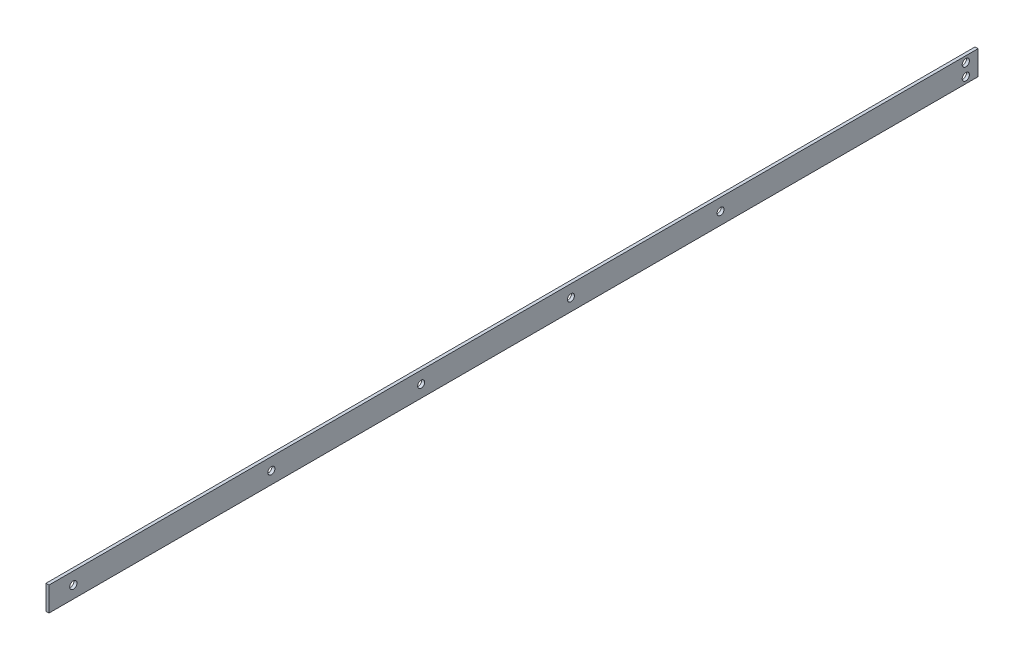
ISO-10303-21;
HEADER;
FILE_DESCRIPTION(('STEP AP214'),'2;1');
FILE_NAME('part.step','',(''),(''),'','','');
FILE_SCHEMA(('AUTOMOTIVE_DESIGN { 1 0 10303 214 1 1 1 1 }'));
ENDSEC;
DATA;
#1=APPLICATION_CONTEXT('core data for automotive mechanical design processes');
#2=APPLICATION_PROTOCOL_DEFINITION('international standard','automotive_design',2000,#1);
#3=PRODUCT_CONTEXT('',#1,'mechanical');
#4=PRODUCT('Part','Part','',(#3));
#5=PRODUCT_RELATED_PRODUCT_CATEGORY('part','',(#4));
#6=PRODUCT_DEFINITION_FORMATION('','',#4);
#7=PRODUCT_DEFINITION_CONTEXT('part definition',#1,'design');
#8=PRODUCT_DEFINITION('design','',#6,#7);
#9=PRODUCT_DEFINITION_SHAPE('','',#8);
#10=(LENGTH_UNIT() NAMED_UNIT(*) SI_UNIT(.MILLI.,.METRE.));
#11=(NAMED_UNIT(*) PLANE_ANGLE_UNIT() SI_UNIT($,.RADIAN.));
#12=(NAMED_UNIT(*) SI_UNIT($,.STERADIAN.) SOLID_ANGLE_UNIT());
#13=UNCERTAINTY_MEASURE_WITH_UNIT(LENGTH_MEASURE(1.E-05),#10,'distance_accuracy_value','');
#14=(GEOMETRIC_REPRESENTATION_CONTEXT(3) GLOBAL_UNCERTAINTY_ASSIGNED_CONTEXT((#13)) GLOBAL_UNIT_ASSIGNED_CONTEXT((#10,
#11,#12)) REPRESENTATION_CONTEXT('',''));
#15=CARTESIAN_POINT('',(0.,0.,0.));
#16=DIRECTION('',(0.,0.,1.));
#17=DIRECTION('',(1.,0.,0.));
#18=AXIS2_PLACEMENT_3D('',#15,#16,#17);
#19=CARTESIAN_POINT('',(0.,0.,485.14));
#20=DIRECTION('',(1.,0.,0.));
#21=DIRECTION('',(0.,1.,0.));
#22=AXIS2_PLACEMENT_3D('',#19,#20,#21);
#23=PLANE('',#22);
#24=CARTESIAN_POINT('',(0.,6.35000000000007,369.033439454375));
#25=DIRECTION('',(1.,0.,0.));
#26=DIRECTION('',(0.,0.,-1.));
#27=AXIS2_PLACEMENT_3D('',#24,#25,#26);
#28=CIRCLE('',#27,1.8288);
#29=CARTESIAN_POINT('',(0.,6.35000000000007,367.204639454375));
#30=VERTEX_POINT('',#29);
#31=EDGE_CURVE('E146',#30,#30,#28,.T.);
#32=ORIENTED_EDGE('',*,*,#31,.T.);
#33=EDGE_LOOP('',(#32));
#34=FACE_BOUND('',#33,.T.);
#35=CARTESIAN_POINT('',(0.,6.35000000000007,290.801439454375));
#36=DIRECTION('',(1.,0.,0.));
#37=DIRECTION('',(0.,0.,-1.));
#38=AXIS2_PLACEMENT_3D('',#35,#36,#37);
#39=CIRCLE('',#38,1.8288);
#40=CARTESIAN_POINT('',(0.,6.35000000000007,288.972639454375));
#41=VERTEX_POINT('',#40);
#42=EDGE_CURVE('E140',#41,#41,#39,.T.);
#43=ORIENTED_EDGE('',*,*,#42,.T.);
#44=EDGE_LOOP('',(#43));
#45=FACE_BOUND('',#44,.T.);
#46=CARTESIAN_POINT('',(0.,6.35000000000007,212.569439454375));
#47=DIRECTION('',(1.,0.,0.));
#48=DIRECTION('',(0.,0.,-1.));
#49=AXIS2_PLACEMENT_3D('',#46,#47,#48);
#50=CIRCLE('',#49,1.8288);
#51=CARTESIAN_POINT('',(0.,6.35000000000007,210.740639454375));
#52=VERTEX_POINT('',#51);
#53=EDGE_CURVE('E134',#52,#52,#50,.T.);
#54=ORIENTED_EDGE('',*,*,#53,.T.);
#55=EDGE_LOOP('',(#54));
#56=FACE_BOUND('',#55,.T.);
#57=CARTESIAN_POINT('',(0.,6.35000000000007,134.430638313341));
#58=DIRECTION('',(1.,0.,0.));
#59=DIRECTION('',(0.,0.,-1.));
#60=AXIS2_PLACEMENT_3D('',#57,#58,#59);
#61=CIRCLE('',#60,1.8288);
#62=CARTESIAN_POINT('',(0.,6.35000000000007,132.601838313341));
#63=VERTEX_POINT('',#62);
#64=EDGE_CURVE('E128',#63,#63,#61,.T.);
#65=ORIENTED_EDGE('',*,*,#64,.T.);
#66=EDGE_LOOP('',(#65));
#67=FACE_BOUND('',#66,.T.);
#68=CARTESIAN_POINT('',(0.,6.35,472.44));
#69=DIRECTION('',(1.,0.,0.));
#70=DIRECTION('',(0.,0.,-1.));
#71=AXIS2_PLACEMENT_3D('',#68,#69,#70);
#72=CIRCLE('',#71,1.89865);
#73=CARTESIAN_POINT('',(0.,6.35,470.54135));
#74=VERTEX_POINT('',#73);
#75=EDGE_CURVE('E122',#74,#74,#72,.T.);
#76=ORIENTED_EDGE('',*,*,#75,.T.);
#77=EDGE_LOOP('',(#76));
#78=FACE_BOUND('',#77,.T.);
#79=CARTESIAN_POINT('',(0.,9.525,6.35000000000002));
#80=DIRECTION('',(1.,0.,0.));
#81=DIRECTION('',(0.,0.,-1.));
#82=AXIS2_PLACEMENT_3D('',#79,#80,#81);
#83=CIRCLE('',#82,1.89865);
#84=CARTESIAN_POINT('',(0.,9.525,4.45135000000002));
#85=VERTEX_POINT('',#84);
#86=EDGE_CURVE('E116',#85,#85,#83,.T.);
#87=ORIENTED_EDGE('',*,*,#86,.T.);
#88=EDGE_LOOP('',(#87));
#89=FACE_BOUND('',#88,.T.);
#90=CARTESIAN_POINT('',(0.,3.175,6.35000000000002));
#91=DIRECTION('',(1.,0.,0.));
#92=DIRECTION('',(0.,0.,-1.));
#93=AXIS2_PLACEMENT_3D('',#90,#91,#92);
#94=CIRCLE('',#93,1.89865);
#95=CARTESIAN_POINT('',(0.,3.175,4.45135000000002));
#96=VERTEX_POINT('',#95);
#97=EDGE_CURVE('E100',#96,#96,#94,.T.);
#98=ORIENTED_EDGE('',*,*,#97,.T.);
#99=EDGE_LOOP('',(#98));
#100=FACE_BOUND('',#99,.T.);
#101=DIRECTION('',(0.,-1.,0.));
#102=VECTOR('',#101,1.);
#103=CARTESIAN_POINT('',(0.,0.,0.));
#104=LINE('',#103,#102);
#105=CARTESIAN_POINT('',(0.,12.7,0.));
#106=VERTEX_POINT('',#105);
#107=CARTESIAN_POINT('',(0.,0.,0.));
#108=VERTEX_POINT('',#107);
#109=EDGE_CURVE('E97',#106,#108,#104,.T.);
#110=ORIENTED_EDGE('',*,*,#109,.T.);
#111=DIRECTION('',(0.,0.,-1.));
#112=VECTOR('',#111,1.);
#113=CARTESIAN_POINT('',(0.,0.,485.14));
#114=LINE('',#113,#112);
#115=CARTESIAN_POINT('',(0.,0.,485.14));
#116=VERTEX_POINT('',#115);
#117=EDGE_CURVE('E11',#116,#108,#114,.T.);
#118=ORIENTED_EDGE('',*,*,#117,.F.);
#119=DIRECTION('',(0.,-1.,0.));
#120=VECTOR('',#119,1.);
#121=CARTESIAN_POINT('',(0.,0.,485.14));
#122=LINE('',#121,#120);
#123=CARTESIAN_POINT('',(0.,12.7,485.14));
#124=VERTEX_POINT('',#123);
#125=EDGE_CURVE('E85',#124,#116,#122,.T.);
#126=ORIENTED_EDGE('',*,*,#125,.F.);
#127=DIRECTION('',(0.,0.,-1.));
#128=VECTOR('',#127,1.);
#129=CARTESIAN_POINT('',(0.,12.7,485.14));
#130=LINE('',#129,#128);
#131=EDGE_CURVE('E93',#124,#106,#130,.T.);
#132=ORIENTED_EDGE('',*,*,#131,.T.);
#133=EDGE_LOOP('',(#110,#118,#126,#132));
#134=FACE_BOUND('',#133,.T.);
#135=ADVANCED_FACE('F34',(#34,#45,#56,#67,#78,#89,#100,#134),#23,.F.);
#136=CARTESIAN_POINT('',(0.,0.,485.14));
#137=DIRECTION('',(0.,1.,0.));
#138=DIRECTION('',(0.,0.,1.));
#139=AXIS2_PLACEMENT_3D('',#136,#137,#138);
#140=PLANE('',#139);
#141=DIRECTION('',(1.,0.,0.));
#142=VECTOR('',#141,1.);
#143=CARTESIAN_POINT('',(0.,0.,0.));
#144=LINE('',#143,#142);
#145=CARTESIAN_POINT('',(1.5875,0.,0.));
#146=VERTEX_POINT('',#145);
#147=EDGE_CURVE('E89',#108,#146,#144,.T.);
#148=ORIENTED_EDGE('',*,*,#147,.T.);
#149=DIRECTION('',(0.,0.,-1.));
#150=VECTOR('',#149,1.);
#151=CARTESIAN_POINT('',(1.5875,0.,485.14));
#152=LINE('',#151,#150);
#153=CARTESIAN_POINT('',(1.5875,0.,485.14));
#154=VERTEX_POINT('',#153);
#155=EDGE_CURVE('E42',#154,#146,#152,.T.);
#156=ORIENTED_EDGE('',*,*,#155,.F.);
#157=DIRECTION('',(1.,0.,0.));
#158=VECTOR('',#157,1.);
#159=CARTESIAN_POINT('',(0.,0.,485.14));
#160=LINE('',#159,#158);
#161=EDGE_CURVE('E80',#116,#154,#160,.T.);
#162=ORIENTED_EDGE('',*,*,#161,.F.);
#163=ORIENTED_EDGE('',*,*,#117,.T.);
#164=EDGE_LOOP('',(#148,#156,#162,#163));
#165=FACE_BOUND('',#164,.T.);
#166=ADVANCED_FACE('F88',(#165),#140,.F.);
#167=CARTESIAN_POINT('',(1.5875,0.,485.14));
#168=DIRECTION('',(-1.,0.,0.));
#169=DIRECTION('',(0.,-1.,0.));
#170=AXIS2_PLACEMENT_3D('',#167,#168,#169);
#171=PLANE('',#170);
#172=CARTESIAN_POINT('',(1.5875,6.35000000000007,369.033439454375));
#173=DIRECTION('',(1.,0.,0.));
#174=DIRECTION('',(0.,0.,-1.));
#175=AXIS2_PLACEMENT_3D('',#172,#173,#174);
#176=CIRCLE('',#175,1.82879999999999);
#177=CARTESIAN_POINT('',(1.5875,6.35000000000007,367.204639454375));
#178=VERTEX_POINT('',#177);
#179=EDGE_CURVE('E149',#178,#178,#176,.T.);
#180=ORIENTED_EDGE('',*,*,#179,.F.);
#181=EDGE_LOOP('',(#180));
#182=FACE_BOUND('',#181,.T.);
#183=CARTESIAN_POINT('',(1.5875,6.35000000000007,290.801439454375));
#184=DIRECTION('',(1.,0.,0.));
#185=DIRECTION('',(0.,0.,-1.));
#186=AXIS2_PLACEMENT_3D('',#183,#184,#185);
#187=CIRCLE('',#186,1.82879999999999);
#188=CARTESIAN_POINT('',(1.5875,6.35000000000007,288.972639454375));
#189=VERTEX_POINT('',#188);
#190=EDGE_CURVE('E143',#189,#189,#187,.T.);
#191=ORIENTED_EDGE('',*,*,#190,.F.);
#192=EDGE_LOOP('',(#191));
#193=FACE_BOUND('',#192,.T.);
#194=CARTESIAN_POINT('',(1.5875,6.35000000000007,212.569439454375));
#195=DIRECTION('',(1.,0.,0.));
#196=DIRECTION('',(0.,0.,-1.));
#197=AXIS2_PLACEMENT_3D('',#194,#195,#196);
#198=CIRCLE('',#197,1.82879999999999);
#199=CARTESIAN_POINT('',(1.5875,6.35000000000007,210.740639454375));
#200=VERTEX_POINT('',#199);
#201=EDGE_CURVE('E137',#200,#200,#198,.T.);
#202=ORIENTED_EDGE('',*,*,#201,.F.);
#203=EDGE_LOOP('',(#202));
#204=FACE_BOUND('',#203,.T.);
#205=CARTESIAN_POINT('',(1.5875,6.35000000000007,134.430638313341));
#206=DIRECTION('',(1.,0.,0.));
#207=DIRECTION('',(0.,0.,-1.));
#208=AXIS2_PLACEMENT_3D('',#205,#206,#207);
#209=CIRCLE('',#208,1.82879999999999);
#210=CARTESIAN_POINT('',(1.5875,6.35000000000007,132.601838313341));
#211=VERTEX_POINT('',#210);
#212=EDGE_CURVE('E131',#211,#211,#209,.T.);
#213=ORIENTED_EDGE('',*,*,#212,.F.);
#214=EDGE_LOOP('',(#213));
#215=FACE_BOUND('',#214,.T.);
#216=CARTESIAN_POINT('',(1.5875,6.35,472.44));
#217=DIRECTION('',(1.,0.,0.));
#218=DIRECTION('',(0.,0.,-1.));
#219=AXIS2_PLACEMENT_3D('',#216,#217,#218);
#220=CIRCLE('',#219,1.89865);
#221=CARTESIAN_POINT('',(1.5875,6.35,470.54135));
#222=VERTEX_POINT('',#221);
#223=EDGE_CURVE('E125',#222,#222,#220,.T.);
#224=ORIENTED_EDGE('',*,*,#223,.F.);
#225=EDGE_LOOP('',(#224));
#226=FACE_BOUND('',#225,.T.);
#227=CARTESIAN_POINT('',(1.5875,9.525,6.35000000000002));
#228=DIRECTION('',(1.,0.,0.));
#229=DIRECTION('',(0.,0.,-1.));
#230=AXIS2_PLACEMENT_3D('',#227,#228,#229);
#231=CIRCLE('',#230,1.89865);
#232=CARTESIAN_POINT('',(1.5875,9.525,4.45135000000002));
#233=VERTEX_POINT('',#232);
#234=EDGE_CURVE('E119',#233,#233,#231,.T.);
#235=ORIENTED_EDGE('',*,*,#234,.F.);
#236=EDGE_LOOP('',(#235));
#237=FACE_BOUND('',#236,.T.);
#238=CARTESIAN_POINT('',(1.5875,3.175,6.35000000000002));
#239=DIRECTION('',(1.,0.,0.));
#240=DIRECTION('',(0.,0.,-1.));
#241=AXIS2_PLACEMENT_3D('',#238,#239,#240);
#242=CIRCLE('',#241,1.89865);
#243=CARTESIAN_POINT('',(1.5875,3.175,4.45135000000002));
#244=VERTEX_POINT('',#243);
#245=EDGE_CURVE('E113',#244,#244,#242,.T.);
#246=ORIENTED_EDGE('',*,*,#245,.F.);
#247=EDGE_LOOP('',(#246));
#248=FACE_BOUND('',#247,.T.);
#249=DIRECTION('',(0.,1.,0.));
#250=VECTOR('',#249,1.);
#251=CARTESIAN_POINT('',(1.5875,0.,0.));
#252=LINE('',#251,#250);
#253=CARTESIAN_POINT('',(1.5875,12.7,0.));
#254=VERTEX_POINT('',#253);
#255=EDGE_CURVE('E67',#146,#254,#252,.T.);
#256=ORIENTED_EDGE('',*,*,#255,.T.);
#257=DIRECTION('',(0.,0.,-1.));
#258=VECTOR('',#257,1.);
#259=CARTESIAN_POINT('',(1.5875,12.7,485.14));
#260=LINE('',#259,#258);
#261=CARTESIAN_POINT('',(1.5875,12.7,485.14));
#262=VERTEX_POINT('',#261);
#263=EDGE_CURVE('E90',#262,#254,#260,.T.);
#264=ORIENTED_EDGE('',*,*,#263,.F.);
#265=DIRECTION('',(0.,1.,0.));
#266=VECTOR('',#265,1.);
#267=CARTESIAN_POINT('',(1.5875,0.,485.14));
#268=LINE('',#267,#266);
#269=EDGE_CURVE('E83',#154,#262,#268,.T.);
#270=ORIENTED_EDGE('',*,*,#269,.F.);
#271=ORIENTED_EDGE('',*,*,#155,.T.);
#272=EDGE_LOOP('',(#256,#264,#270,#271));
#273=FACE_BOUND('',#272,.T.);
#274=ADVANCED_FACE('F91',(#182,#193,#204,#215,#226,#237,#248,#273),#171,.F.);
#275=CARTESIAN_POINT('',(0.,12.7,485.14));
#276=DIRECTION('',(0.,-1.,0.));
#277=DIRECTION('',(0.,0.,-1.));
#278=AXIS2_PLACEMENT_3D('',#275,#276,#277);
#279=PLANE('',#278);
#280=DIRECTION('',(-1.,0.,0.));
#281=VECTOR('',#280,1.);
#282=CARTESIAN_POINT('',(0.,12.7,0.));
#283=LINE('',#282,#281);
#284=EDGE_CURVE('E73',#254,#106,#283,.T.);
#285=ORIENTED_EDGE('',*,*,#284,.T.);
#286=ORIENTED_EDGE('',*,*,#131,.F.);
#287=DIRECTION('',(-1.,0.,0.));
#288=VECTOR('',#287,1.);
#289=CARTESIAN_POINT('',(0.,12.7,485.14));
#290=LINE('',#289,#288);
#291=EDGE_CURVE('E50',#262,#124,#290,.T.);
#292=ORIENTED_EDGE('',*,*,#291,.F.);
#293=ORIENTED_EDGE('',*,*,#263,.T.);
#294=EDGE_LOOP('',(#285,#286,#292,#293));
#295=FACE_BOUND('',#294,.T.);
#296=ADVANCED_FACE('F105',(#295),#279,.F.);
#297=CARTESIAN_POINT('',(0.,0.,485.14));
#298=DIRECTION('',(0.,0.,-1.));
#299=DIRECTION('',(-1.,0.,0.));
#300=AXIS2_PLACEMENT_3D('',#297,#298,#299);
#301=PLANE('',#300);
#302=ORIENTED_EDGE('',*,*,#125,.T.);
#303=ORIENTED_EDGE('',*,*,#161,.T.);
#304=ORIENTED_EDGE('',*,*,#269,.T.);
#305=ORIENTED_EDGE('',*,*,#291,.T.);
#306=EDGE_LOOP('',(#302,#303,#304,#305));
#307=FACE_BOUND('',#306,.T.);
#308=ADVANCED_FACE('F81',(#307),#301,.F.);
#309=CARTESIAN_POINT('',(0.,0.,0.));
#310=DIRECTION('',(0.,0.,-1.));
#311=DIRECTION('',(-1.,0.,0.));
#312=AXIS2_PLACEMENT_3D('',#309,#310,#311);
#313=PLANE('',#312);
#314=ORIENTED_EDGE('',*,*,#109,.F.);
#315=ORIENTED_EDGE('',*,*,#284,.F.);
#316=ORIENTED_EDGE('',*,*,#255,.F.);
#317=ORIENTED_EDGE('',*,*,#147,.F.);
#318=EDGE_LOOP('',(#314,#315,#316,#317));
#319=FACE_BOUND('',#318,.T.);
#320=ADVANCED_FACE('F108',(#319),#313,.T.);
#321=CARTESIAN_POINT('',(1.5875,3.175,6.35000000000002));
#322=DIRECTION('',(1.,0.,0.));
#323=DIRECTION('',(0.,0.,-1.));
#324=AXIS2_PLACEMENT_3D('',#321,#322,#323);
#325=CYLINDRICAL_SURFACE('',#324,1.89865);
#326=ORIENTED_EDGE('',*,*,#97,.F.);
#327=EDGE_LOOP('',(#326));
#328=FACE_BOUND('',#327,.T.);
#329=ORIENTED_EDGE('',*,*,#245,.T.);
#330=EDGE_LOOP('',(#329));
#331=FACE_BOUND('',#330,.T.);
#332=ADVANCED_FACE('F170',(#328,#331),#325,.F.);
#333=CARTESIAN_POINT('',(1.5875,9.525,6.35000000000002));
#334=DIRECTION('',(1.,0.,0.));
#335=DIRECTION('',(0.,0.,-1.));
#336=AXIS2_PLACEMENT_3D('',#333,#334,#335);
#337=CYLINDRICAL_SURFACE('',#336,1.89865);
#338=ORIENTED_EDGE('',*,*,#86,.F.);
#339=EDGE_LOOP('',(#338));
#340=FACE_BOUND('',#339,.T.);
#341=ORIENTED_EDGE('',*,*,#234,.T.);
#342=EDGE_LOOP('',(#341));
#343=FACE_BOUND('',#342,.T.);
#344=ADVANCED_FACE('F172',(#340,#343),#337,.F.);
#345=CARTESIAN_POINT('',(1.5875,6.35,472.44));
#346=DIRECTION('',(1.,0.,0.));
#347=DIRECTION('',(0.,0.,-1.));
#348=AXIS2_PLACEMENT_3D('',#345,#346,#347);
#349=CYLINDRICAL_SURFACE('',#348,1.89865);
#350=ORIENTED_EDGE('',*,*,#75,.F.);
#351=EDGE_LOOP('',(#350));
#352=FACE_BOUND('',#351,.T.);
#353=ORIENTED_EDGE('',*,*,#223,.T.);
#354=EDGE_LOOP('',(#353));
#355=FACE_BOUND('',#354,.T.);
#356=ADVANCED_FACE('F179',(#352,#355),#349,.F.);
#357=CARTESIAN_POINT('',(1.5875,6.35000000000007,134.430638313341));
#358=DIRECTION('',(1.,0.,0.));
#359=DIRECTION('',(0.,0.,-1.));
#360=AXIS2_PLACEMENT_3D('',#357,#358,#359);
#361=CYLINDRICAL_SURFACE('',#360,1.82879999999999);
#362=ORIENTED_EDGE('',*,*,#64,.F.);
#363=EDGE_LOOP('',(#362));
#364=FACE_BOUND('',#363,.T.);
#365=ORIENTED_EDGE('',*,*,#212,.T.);
#366=EDGE_LOOP('',(#365));
#367=FACE_BOUND('',#366,.T.);
#368=ADVANCED_FACE('F206',(#364,#367),#361,.F.);
#369=CARTESIAN_POINT('',(1.5875,6.35000000000007,212.569439454375));
#370=DIRECTION('',(1.,0.,0.));
#371=DIRECTION('',(0.,0.,-1.));
#372=AXIS2_PLACEMENT_3D('',#369,#370,#371);
#373=CYLINDRICAL_SURFACE('',#372,1.82879999999999);
#374=ORIENTED_EDGE('',*,*,#53,.F.);
#375=EDGE_LOOP('',(#374));
#376=FACE_BOUND('',#375,.T.);
#377=ORIENTED_EDGE('',*,*,#201,.T.);
#378=EDGE_LOOP('',(#377));
#379=FACE_BOUND('',#378,.T.);
#380=ADVANCED_FACE('F211',(#376,#379),#373,.F.);
#381=CARTESIAN_POINT('',(1.5875,6.35000000000007,290.801439454375));
#382=DIRECTION('',(1.,0.,0.));
#383=DIRECTION('',(0.,0.,-1.));
#384=AXIS2_PLACEMENT_3D('',#381,#382,#383);
#385=CYLINDRICAL_SURFACE('',#384,1.82879999999999);
#386=ORIENTED_EDGE('',*,*,#42,.F.);
#387=EDGE_LOOP('',(#386));
#388=FACE_BOUND('',#387,.T.);
#389=ORIENTED_EDGE('',*,*,#190,.T.);
#390=EDGE_LOOP('',(#389));
#391=FACE_BOUND('',#390,.T.);
#392=ADVANCED_FACE('F217',(#388,#391),#385,.F.);
#393=CARTESIAN_POINT('',(1.5875,6.35000000000007,369.033439454375));
#394=DIRECTION('',(1.,0.,0.));
#395=DIRECTION('',(0.,0.,-1.));
#396=AXIS2_PLACEMENT_3D('',#393,#394,#395);
#397=CYLINDRICAL_SURFACE('',#396,1.82879999999999);
#398=ORIENTED_EDGE('',*,*,#31,.F.);
#399=EDGE_LOOP('',(#398));
#400=FACE_BOUND('',#399,.T.);
#401=ORIENTED_EDGE('',*,*,#179,.T.);
#402=EDGE_LOOP('',(#401));
#403=FACE_BOUND('',#402,.T.);
#404=ADVANCED_FACE('F153',(#400,#403),#397,.F.);
#405=CLOSED_SHELL('',(#135,#166,#274,#296,#308,#320,#332,#344,#356,#368,#380,#392,#404));
#406=MANIFOLD_SOLID_BREP('B2',#405);
#407=ADVANCED_BREP_SHAPE_REPRESENTATION('',(#18,#406),#14);
#408=SHAPE_DEFINITION_REPRESENTATION(#9,#407);
ENDSEC;
END-ISO-10303-21;
